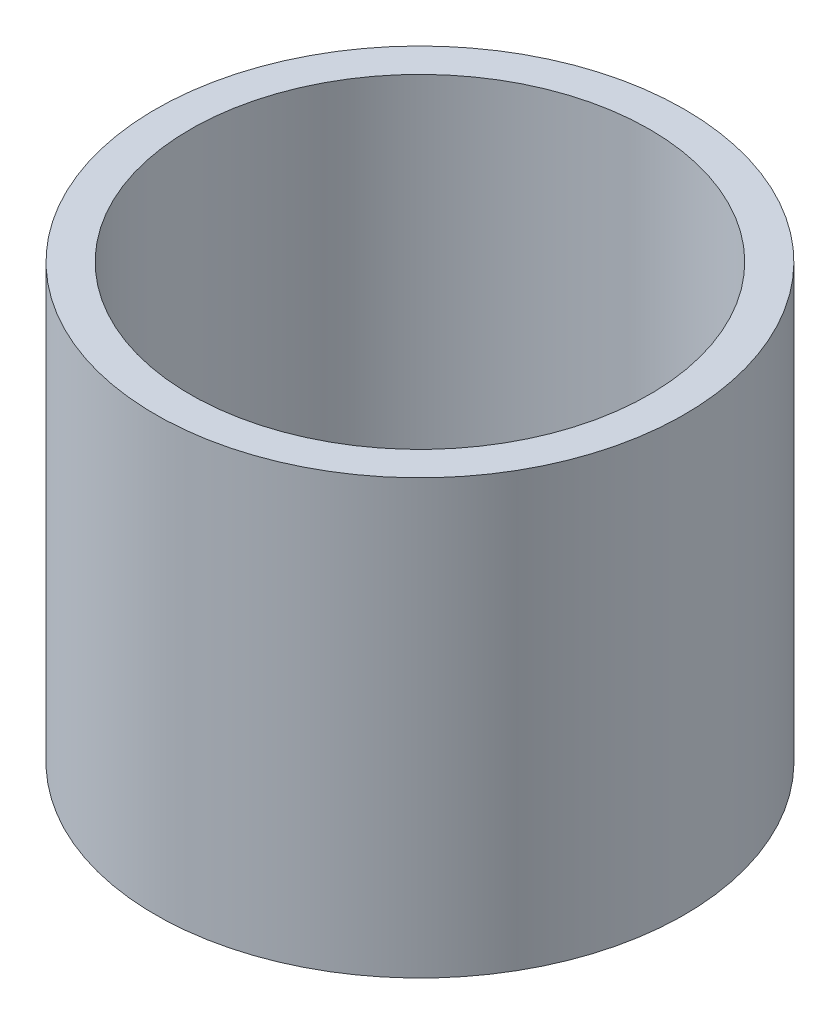
ISO-10303-21;
HEADER;
FILE_DESCRIPTION(('STEP AP214'),'2;1');
FILE_NAME('part.step','',(''),(''),'','','');
FILE_SCHEMA(('AUTOMOTIVE_DESIGN { 1 0 10303 214 1 1 1 1 }'));
ENDSEC;
DATA;
#1=APPLICATION_CONTEXT('core data for automotive mechanical design processes');
#2=APPLICATION_PROTOCOL_DEFINITION('international standard','automotive_design',2000,#1);
#3=PRODUCT_CONTEXT('',#1,'mechanical');
#4=PRODUCT('Part','Part','',(#3));
#5=PRODUCT_RELATED_PRODUCT_CATEGORY('part','',(#4));
#6=PRODUCT_DEFINITION_FORMATION('','',#4);
#7=PRODUCT_DEFINITION_CONTEXT('part definition',#1,'design');
#8=PRODUCT_DEFINITION('design','',#6,#7);
#9=PRODUCT_DEFINITION_SHAPE('','',#8);
#10=(LENGTH_UNIT() NAMED_UNIT(*) SI_UNIT(.MILLI.,.METRE.));
#11=(NAMED_UNIT(*) PLANE_ANGLE_UNIT() SI_UNIT($,.RADIAN.));
#12=(NAMED_UNIT(*) SI_UNIT($,.STERADIAN.) SOLID_ANGLE_UNIT());
#13=UNCERTAINTY_MEASURE_WITH_UNIT(LENGTH_MEASURE(1.E-05),#10,'distance_accuracy_value','');
#14=(GEOMETRIC_REPRESENTATION_CONTEXT(3) GLOBAL_UNCERTAINTY_ASSIGNED_CONTEXT((#13)) GLOBAL_UNIT_ASSIGNED_CONTEXT((#10,
#11,#12)) REPRESENTATION_CONTEXT('',''));
#15=CARTESIAN_POINT('',(0.,0.,0.));
#16=DIRECTION('',(0.,0.,1.));
#17=DIRECTION('',(1.,0.,0.));
#18=AXIS2_PLACEMENT_3D('',#15,#16,#17);
#19=CARTESIAN_POINT('',(0.,49.1505779069963,0.));
#20=DIRECTION('',(0.,-1.,0.));
#21=DIRECTION('',(0.,0.,-1.));
#22=AXIS2_PLACEMENT_3D('',#19,#20,#21);
#23=CYLINDRICAL_SURFACE('',#22,30.);
#24=CARTESIAN_POINT('',(0.,49.1505779069963,0.));
#25=DIRECTION('',(0.,1.,0.));
#26=DIRECTION('',(0.,0.,1.));
#27=AXIS2_PLACEMENT_3D('',#24,#25,#26);
#28=CIRCLE('',#27,30.);
#29=CARTESIAN_POINT('',(0.,49.1505779069963,-30.));
#30=VERTEX_POINT('',#29);
#31=EDGE_CURVE('E10',#30,#30,#28,.T.);
#32=CARTESIAN_POINT('',(0.,0.,0.));
#33=DIRECTION('',(0.,1.,0.));
#34=DIRECTION('',(0.,0.,1.));
#35=AXIS2_PLACEMENT_3D('',#32,#33,#34);
#36=CIRCLE('',#35,30.);
#37=CARTESIAN_POINT('',(0.,0.,-30.));
#38=VERTEX_POINT('',#37);
#39=EDGE_CURVE('E37',#38,#38,#36,.T.);
#40=CARTESIAN_POINT('',(0.,49.1505779069963,-30.));
#41=CARTESIAN_POINT('',(0.,48.6385927204651,-30.));
#42=CARTESIAN_POINT('',(0.,48.1266075339339,-30.));
#43=CARTESIAN_POINT('',(0.,47.1026371608714,-30.));
#44=CARTESIAN_POINT('',(0.,46.5906519743402,-30.));
#45=CARTESIAN_POINT('',(0.,45.5666816012778,-30.));
#46=CARTESIAN_POINT('',(0.,45.0546964147466,-30.));
#47=CARTESIAN_POINT('',(0.,44.0307260416842,-30.));
#48=CARTESIAN_POINT('',(0.,43.518740855153,-30.));
#49=CARTESIAN_POINT('',(0.,42.4947704820905,-30.));
#50=CARTESIAN_POINT('',(0.,41.9827852955593,-30.));
#51=CARTESIAN_POINT('',(0.,40.9588149224969,-30.));
#52=CARTESIAN_POINT('',(0.,40.4468297359657,-30.));
#53=CARTESIAN_POINT('',(0.,39.4228593629033,-30.));
#54=CARTESIAN_POINT('',(0.,38.9108741763721,-30.));
#55=CARTESIAN_POINT('',(0.,37.8869038033096,-30.));
#56=CARTESIAN_POINT('',(0.,37.3749186167784,-30.));
#57=CARTESIAN_POINT('',(0.,36.350948243716,-30.));
#58=CARTESIAN_POINT('',(0.,35.8389630571848,-30.));
#59=CARTESIAN_POINT('',(0.,34.8149926841224,-30.));
#60=CARTESIAN_POINT('',(0.,34.3030074975912,-30.));
#61=CARTESIAN_POINT('',(0.,33.2790371245287,-30.));
#62=CARTESIAN_POINT('',(0.,32.7670519379975,-30.));
#63=CARTESIAN_POINT('',(0.,31.7430815649351,-30.));
#64=CARTESIAN_POINT('',(0.,31.2310963784039,-30.));
#65=CARTESIAN_POINT('',(0.,30.2071260053415,-30.));
#66=CARTESIAN_POINT('',(0.,29.6951408188103,-30.));
#67=CARTESIAN_POINT('',(0.,28.6711704457478,-30.));
#68=CARTESIAN_POINT('',(0.,28.1591852592166,-30.));
#69=CARTESIAN_POINT('',(0.,27.1352148861542,-30.));
#70=CARTESIAN_POINT('',(0.,26.623229699623,-30.));
#71=CARTESIAN_POINT('',(0.,25.5992593265606,-30.));
#72=CARTESIAN_POINT('',(0.,25.0872741400294,-30.));
#73=CARTESIAN_POINT('',(0.,24.0633037669669,-30.));
#74=CARTESIAN_POINT('',(0.,23.5513185804357,-30.));
#75=CARTESIAN_POINT('',(0.,22.5273482073733,-30.));
#76=CARTESIAN_POINT('',(0.,22.0153630208421,-30.));
#77=CARTESIAN_POINT('',(0.,20.9913926477797,-30.));
#78=CARTESIAN_POINT('',(0.,20.4794074612485,-30.));
#79=CARTESIAN_POINT('',(0.,19.455437088186,-30.));
#80=CARTESIAN_POINT('',(0.,18.9434519016548,-30.));
#81=CARTESIAN_POINT('',(0.,17.9194815285924,-30.));
#82=CARTESIAN_POINT('',(0.,17.4074963420612,-30.));
#83=CARTESIAN_POINT('',(0.,16.3835259689988,-30.));
#84=CARTESIAN_POINT('',(0.,15.8715407824675,-30.));
#85=CARTESIAN_POINT('',(0.,14.8475704094051,-30.));
#86=CARTESIAN_POINT('',(0.,14.3355852228739,-30.));
#87=CARTESIAN_POINT('',(0.,13.3116148498115,-30.));
#88=CARTESIAN_POINT('',(0.,12.7996296632803,-30.));
#89=CARTESIAN_POINT('',(0.,11.7756592902179,-30.));
#90=CARTESIAN_POINT('',(0.,11.2636741036866,-30.));
#91=CARTESIAN_POINT('',(0.,10.2397037306242,-30.));
#92=CARTESIAN_POINT('',(0.,9.72771854409302,-30.));
#93=CARTESIAN_POINT('',(0.,8.70374817103059,-30.));
#94=CARTESIAN_POINT('',(0.,8.19176298449938,-30.));
#95=CARTESIAN_POINT('',(0.,7.16779261143696,-30.));
#96=CARTESIAN_POINT('',(0.,6.65580742490575,-30.));
#97=CARTESIAN_POINT('',(0.,5.63183705184332,-30.));
#98=CARTESIAN_POINT('',(0.,5.11985186531211,-30.));
#99=CARTESIAN_POINT('',(0.,4.09588149224969,-30.));
#100=CARTESIAN_POINT('',(0.,3.58389630571848,-30.));
#101=CARTESIAN_POINT('',(0.,2.55992593265606,-30.));
#102=CARTESIAN_POINT('',(0.,2.04794074612485,-30.));
#103=CARTESIAN_POINT('',(0.,1.02397037306242,-30.));
#104=CARTESIAN_POINT('',(0.,0.511985186531211,-30.));
#105=CARTESIAN_POINT('',(0.,0.,-30.));
#106=B_SPLINE_CURVE_WITH_KNOTS('',3,(#40,#41,#42,#43,#44,#45,#46,#47,#48,#49,#50,#51,#52,#53,
#54,#55,#56,#57,#58,#59,#60,#61,#62,#63,#64,#65,#66,#67,#68,#69,#70,#71,#72,#73,#74,#75,#76,#77,
#78,#79,#80,#81,#82,#83,#84,#85,#86,#87,#88,#89,#90,#91,#92,#93,#94,#95,#96,#97,#98,#99,#100,
#101,#102,#103,#104,#105),.UNSPECIFIED.,.F.,.F.,(4,2,2,2,2,2,2,2,2,2,2,2,2,2,2,2,2,2,2,2,2,2,2,
2,2,2,2,2,2,2,2,2,4),(0.,1.53595555959363,3.07191111918727,4.6078666787809,6.14382223837454,
7.67977779796816,9.2157333575618,10.7516889171554,12.2876444767491,13.8236000363427,
15.3595555959363,16.89551115553,18.4314667151236,19.9674222747172,21.5033778343109,
23.0393333939045,24.5752889534981,26.1112445130918,27.6472000726854,29.183155632279,
30.7191111918727,32.2550667514663,33.7910223110599,35.3269778706536,36.8629334302472,
38.3988889898408,39.9348445494345,41.4708001090281,43.0067556686218,44.5427112282154,
46.078666787809,47.6146223474027,49.1505779069963),.UNSPECIFIED.);
#107=EDGE_CURVE('BSEAM40',#30,#38,#106,.T.);
#108=ORIENTED_EDGE('',*,*,#31,.F.);
#109=ORIENTED_EDGE('',*,*,#39,.T.);
#110=ORIENTED_EDGE('',*,*,#107,.T.);
#111=ORIENTED_EDGE('',*,*,#107,.F.);
#112=EDGE_LOOP('',(#108,#110,#109,#111));
#113=FACE_BOUND('',#112,.T.);
#114=ADVANCED_FACE('F40',(#113),#23,.T.);
#115=CARTESIAN_POINT('',(0.,49.1505779069963,0.));
#116=DIRECTION('',(0.,1.,0.));
#117=DIRECTION('',(0.,0.,1.));
#118=AXIS2_PLACEMENT_3D('',#115,#116,#117);
#119=PLANE('',#118);
#120=CARTESIAN_POINT('',(0.,49.1505779069963,0.));
#121=DIRECTION('',(0.,1.,0.));
#122=DIRECTION('',(0.,0.,1.));
#123=AXIS2_PLACEMENT_3D('',#120,#121,#122);
#124=CIRCLE('',#123,26.0572707205957);
#125=CARTESIAN_POINT('',(0.,49.1505779069963,-26.0572707205957));
#126=VERTEX_POINT('',#125);
#127=EDGE_CURVE('E50',#126,#126,#124,.T.);
#128=ORIENTED_EDGE('',*,*,#127,.F.);
#129=EDGE_LOOP('',(#128));
#130=FACE_BOUND('',#129,.T.);
#131=ORIENTED_EDGE('',*,*,#31,.T.);
#132=EDGE_LOOP('',(#131));
#133=FACE_BOUND('',#132,.T.);
#134=ADVANCED_FACE('F59',(#130,#133),#119,.T.);
#135=CARTESIAN_POINT('',(0.,0.,0.));
#136=DIRECTION('',(0.,1.,0.));
#137=DIRECTION('',(0.,0.,1.));
#138=AXIS2_PLACEMENT_3D('',#135,#136,#137);
#139=PLANE('',#138);
#140=CARTESIAN_POINT('',(0.,0.,0.));
#141=DIRECTION('',(0.,1.,0.));
#142=DIRECTION('',(0.,0.,1.));
#143=AXIS2_PLACEMENT_3D('',#140,#141,#142);
#144=CIRCLE('',#143,26.0572707205957);
#145=CARTESIAN_POINT('',(0.,0.,-26.0572707205957));
#146=VERTEX_POINT('',#145);
#147=EDGE_CURVE('E47',#146,#146,#144,.T.);
#148=ORIENTED_EDGE('',*,*,#147,.T.);
#149=EDGE_LOOP('',(#148));
#150=FACE_BOUND('',#149,.T.);
#151=ORIENTED_EDGE('',*,*,#39,.F.);
#152=EDGE_LOOP('',(#151));
#153=FACE_BOUND('',#152,.T.);
#154=ADVANCED_FACE('F58',(#150,#153),#139,.F.);
#155=CARTESIAN_POINT('',(0.,49.1505779069963,0.));
#156=DIRECTION('',(0.,-1.,0.));
#157=DIRECTION('',(0.,0.,-1.));
#158=AXIS2_PLACEMENT_3D('',#155,#156,#157);
#159=CYLINDRICAL_SURFACE('',#158,26.0572707205957);
#160=CARTESIAN_POINT('',(0.,49.1505779069963,-26.0572707205957));
#161=CARTESIAN_POINT('',(0.,48.6385927204651,-26.0572707205957));
#162=CARTESIAN_POINT('',(0.,48.1266075339339,-26.0572707205957));
#163=CARTESIAN_POINT('',(0.,47.1026371608714,-26.0572707205957));
#164=CARTESIAN_POINT('',(0.,46.5906519743402,-26.0572707205957));
#165=CARTESIAN_POINT('',(0.,45.5666816012778,-26.0572707205957));
#166=CARTESIAN_POINT('',(0.,45.0546964147466,-26.0572707205957));
#167=CARTESIAN_POINT('',(0.,44.0307260416842,-26.0572707205957));
#168=CARTESIAN_POINT('',(0.,43.518740855153,-26.0572707205957));
#169=CARTESIAN_POINT('',(0.,42.4947704820905,-26.0572707205957));
#170=CARTESIAN_POINT('',(0.,41.9827852955593,-26.0572707205957));
#171=CARTESIAN_POINT('',(0.,40.9588149224969,-26.0572707205957));
#172=CARTESIAN_POINT('',(0.,40.4468297359657,-26.0572707205957));
#173=CARTESIAN_POINT('',(0.,39.4228593629033,-26.0572707205957));
#174=CARTESIAN_POINT('',(0.,38.9108741763721,-26.0572707205957));
#175=CARTESIAN_POINT('',(0.,37.8869038033096,-26.0572707205957));
#176=CARTESIAN_POINT('',(0.,37.3749186167784,-26.0572707205957));
#177=CARTESIAN_POINT('',(0.,36.350948243716,-26.0572707205957));
#178=CARTESIAN_POINT('',(0.,35.8389630571848,-26.0572707205957));
#179=CARTESIAN_POINT('',(0.,34.8149926841224,-26.0572707205957));
#180=CARTESIAN_POINT('',(0.,34.3030074975912,-26.0572707205957));
#181=CARTESIAN_POINT('',(0.,33.2790371245287,-26.0572707205957));
#182=CARTESIAN_POINT('',(0.,32.7670519379975,-26.0572707205957));
#183=CARTESIAN_POINT('',(0.,31.7430815649351,-26.0572707205957));
#184=CARTESIAN_POINT('',(0.,31.2310963784039,-26.0572707205957));
#185=CARTESIAN_POINT('',(0.,30.2071260053415,-26.0572707205957));
#186=CARTESIAN_POINT('',(0.,29.6951408188103,-26.0572707205957));
#187=CARTESIAN_POINT('',(0.,28.6711704457478,-26.0572707205957));
#188=CARTESIAN_POINT('',(0.,28.1591852592166,-26.0572707205957));
#189=CARTESIAN_POINT('',(0.,27.1352148861542,-26.0572707205957));
#190=CARTESIAN_POINT('',(0.,26.623229699623,-26.0572707205957));
#191=CARTESIAN_POINT('',(0.,25.5992593265606,-26.0572707205957));
#192=CARTESIAN_POINT('',(0.,25.0872741400294,-26.0572707205957));
#193=CARTESIAN_POINT('',(0.,24.0633037669669,-26.0572707205957));
#194=CARTESIAN_POINT('',(0.,23.5513185804357,-26.0572707205957));
#195=CARTESIAN_POINT('',(0.,22.5273482073733,-26.0572707205957));
#196=CARTESIAN_POINT('',(0.,22.0153630208421,-26.0572707205957));
#197=CARTESIAN_POINT('',(0.,20.9913926477797,-26.0572707205957));
#198=CARTESIAN_POINT('',(0.,20.4794074612485,-26.0572707205957));
#199=CARTESIAN_POINT('',(0.,19.455437088186,-26.0572707205957));
#200=CARTESIAN_POINT('',(0.,18.9434519016548,-26.0572707205957));
#201=CARTESIAN_POINT('',(0.,17.9194815285924,-26.0572707205957));
#202=CARTESIAN_POINT('',(0.,17.4074963420612,-26.0572707205957));
#203=CARTESIAN_POINT('',(0.,16.3835259689988,-26.0572707205957));
#204=CARTESIAN_POINT('',(0.,15.8715407824675,-26.0572707205957));
#205=CARTESIAN_POINT('',(0.,14.8475704094051,-26.0572707205957));
#206=CARTESIAN_POINT('',(0.,14.3355852228739,-26.0572707205957));
#207=CARTESIAN_POINT('',(0.,13.3116148498115,-26.0572707205957));
#208=CARTESIAN_POINT('',(0.,12.7996296632803,-26.0572707205957));
#209=CARTESIAN_POINT('',(0.,11.7756592902179,-26.0572707205957));
#210=CARTESIAN_POINT('',(0.,11.2636741036866,-26.0572707205957));
#211=CARTESIAN_POINT('',(0.,10.2397037306242,-26.0572707205957));
#212=CARTESIAN_POINT('',(0.,9.72771854409302,-26.0572707205957));
#213=CARTESIAN_POINT('',(0.,8.70374817103059,-26.0572707205957));
#214=CARTESIAN_POINT('',(0.,8.19176298449938,-26.0572707205957));
#215=CARTESIAN_POINT('',(0.,7.16779261143696,-26.0572707205957));
#216=CARTESIAN_POINT('',(0.,6.65580742490575,-26.0572707205957));
#217=CARTESIAN_POINT('',(0.,5.63183705184332,-26.0572707205957));
#218=CARTESIAN_POINT('',(0.,5.11985186531211,-26.0572707205957));
#219=CARTESIAN_POINT('',(0.,4.09588149224969,-26.0572707205957));
#220=CARTESIAN_POINT('',(0.,3.58389630571848,-26.0572707205957));
#221=CARTESIAN_POINT('',(0.,2.55992593265606,-26.0572707205957));
#222=CARTESIAN_POINT('',(0.,2.04794074612485,-26.0572707205957));
#223=CARTESIAN_POINT('',(0.,1.02397037306242,-26.0572707205957));
#224=CARTESIAN_POINT('',(0.,0.511985186531211,-26.0572707205957));
#225=CARTESIAN_POINT('',(0.,0.,-26.0572707205957));
#226=B_SPLINE_CURVE_WITH_KNOTS('',3,(#160,#161,#162,#163,#164,#165,#166,#167,#168,#169,#170,
#171,#172,#173,#174,#175,#176,#177,#178,#179,#180,#181,#182,#183,#184,#185,#186,#187,#188,#189,
#190,#191,#192,#193,#194,#195,#196,#197,#198,#199,#200,#201,#202,#203,#204,#205,#206,#207,#208,
#209,#210,#211,#212,#213,#214,#215,#216,#217,#218,#219,#220,#221,#222,#223,#224,#225),
.UNSPECIFIED.,.F.,.F.,(4,2,2,2,2,2,2,2,2,2,2,2,2,2,2,2,2,2,2,2,2,2,2,2,2,2,2,2,2,2,2,2,4),(0.,
1.53595555959363,3.07191111918727,4.6078666787809,6.14382223837454,7.67977779796816,
9.2157333575618,10.7516889171554,12.2876444767491,13.8236000363427,15.3595555959363,
16.89551115553,18.4314667151236,19.9674222747172,21.5033778343109,23.0393333939045,
24.5752889534981,26.1112445130918,27.6472000726854,29.183155632279,30.7191111918727,
32.2550667514663,33.7910223110599,35.3269778706536,36.8629334302472,38.3988889898408,
39.9348445494345,41.4708001090281,43.0067556686218,44.5427112282154,46.078666787809,
47.6146223474027,49.1505779069963),.UNSPECIFIED.);
#227=EDGE_CURVE('BSEAM54',#126,#146,#226,.T.);
#228=ORIENTED_EDGE('',*,*,#127,.T.);
#229=ORIENTED_EDGE('',*,*,#147,.F.);
#230=ORIENTED_EDGE('',*,*,#227,.T.);
#231=ORIENTED_EDGE('',*,*,#227,.F.);
#232=EDGE_LOOP('',(#228,#230,#229,#231));
#233=FACE_BOUND('',#232,.T.);
#234=ADVANCED_FACE('F54',(#233),#159,.F.);
#235=CLOSED_SHELL('',(#114,#134,#154,#234));
#236=MANIFOLD_SOLID_BREP('B2',#235);
#237=ADVANCED_BREP_SHAPE_REPRESENTATION('',(#18,#236),#14);
#238=SHAPE_DEFINITION_REPRESENTATION(#9,#237);
ENDSEC;
END-ISO-10303-21;
